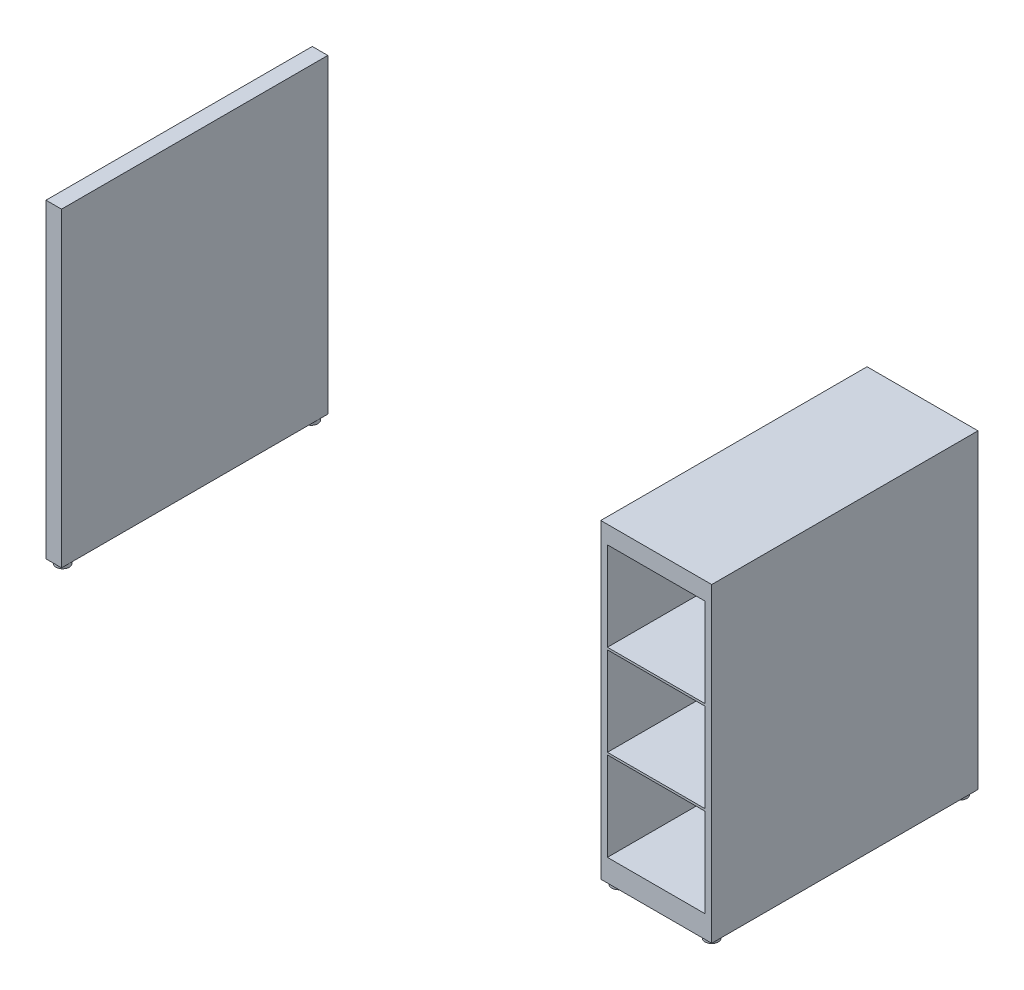
ISO-10303-21;
HEADER;
FILE_DESCRIPTION(('STEP AP214'),'2;1');
FILE_NAME('part.step','',(''),(''),'','','');
FILE_SCHEMA(('AUTOMOTIVE_DESIGN { 1 0 10303 214 1 1 1 1 }'));
ENDSEC;
DATA;
#1=APPLICATION_CONTEXT('core data for automotive mechanical design processes');
#2=APPLICATION_PROTOCOL_DEFINITION('international standard','automotive_design',2000,#1);
#3=PRODUCT_CONTEXT('',#1,'mechanical');
#4=PRODUCT('Part','Part','',(#3));
#5=PRODUCT_RELATED_PRODUCT_CATEGORY('part','',(#4));
#6=PRODUCT_DEFINITION_FORMATION('','',#4);
#7=PRODUCT_DEFINITION_CONTEXT('part definition',#1,'design');
#8=PRODUCT_DEFINITION('design','',#6,#7);
#9=PRODUCT_DEFINITION_SHAPE('','',#8);
#10=(LENGTH_UNIT() NAMED_UNIT(*) SI_UNIT(.MILLI.,.METRE.));
#11=(NAMED_UNIT(*) PLANE_ANGLE_UNIT() SI_UNIT($,.RADIAN.));
#12=(NAMED_UNIT(*) SI_UNIT($,.STERADIAN.) SOLID_ANGLE_UNIT());
#13=UNCERTAINTY_MEASURE_WITH_UNIT(LENGTH_MEASURE(1.E-05),#10,'distance_accuracy_value','');
#14=(GEOMETRIC_REPRESENTATION_CONTEXT(3) GLOBAL_UNCERTAINTY_ASSIGNED_CONTEXT((#13)) GLOBAL_UNIT_ASSIGNED_CONTEXT((#10,
#11,#12)) REPRESENTATION_CONTEXT('',''));
#15=CARTESIAN_POINT('',(0.,0.,0.));
#16=DIRECTION('',(0.,0.,1.));
#17=DIRECTION('',(1.,0.,0.));
#18=AXIS2_PLACEMENT_3D('',#15,#16,#17);
#19=CARTESIAN_POINT('',(-750.,700.,300.));
#20=DIRECTION('',(0.,0.,-1.));
#21=DIRECTION('',(-1.,0.,0.));
#22=AXIS2_PLACEMENT_3D('',#19,#20,#21);
#23=PLANE('',#22);
#24=DIRECTION('',(1.,0.,0.));
#25=VECTOR('',#24,1.);
#26=CARTESIAN_POINT('',(-750.,0.,300.));
#27=LINE('',#26,#25);
#28=CARTESIAN_POINT('',(-750.,0.,300.));
#29=VERTEX_POINT('',#28);
#30=CARTESIAN_POINT('',(-715.,0.,300.));
#31=VERTEX_POINT('',#30);
#32=EDGE_CURVE('E104',#29,#31,#27,.T.);
#33=ORIENTED_EDGE('',*,*,#32,.T.);
#34=DIRECTION('',(0.,-1.,0.));
#35=VECTOR('',#34,1.);
#36=CARTESIAN_POINT('',(-715.,0.,300.));
#37=LINE('',#36,#35);
#38=CARTESIAN_POINT('',(-715.,700.,300.));
#39=VERTEX_POINT('',#38);
#40=EDGE_CURVE('E89',#39,#31,#37,.T.);
#41=ORIENTED_EDGE('',*,*,#40,.F.);
#42=DIRECTION('',(1.,0.,0.));
#43=VECTOR('',#42,1.);
#44=CARTESIAN_POINT('',(-750.,700.,300.));
#45=LINE('',#44,#43);
#46=CARTESIAN_POINT('',(-750.,700.,300.));
#47=VERTEX_POINT('',#46);
#48=EDGE_CURVE('E102',#47,#39,#45,.T.);
#49=ORIENTED_EDGE('',*,*,#48,.F.);
#50=DIRECTION('',(0.,-1.,0.));
#51=VECTOR('',#50,1.);
#52=CARTESIAN_POINT('',(-750.,700.,300.));
#53=LINE('',#52,#51);
#54=EDGE_CURVE('E120',#47,#29,#53,.T.);
#55=ORIENTED_EDGE('',*,*,#54,.T.);
#56=EDGE_LOOP('',(#33,#41,#49,#55));
#57=FACE_BOUND('',#56,.T.);
#58=ADVANCED_FACE('F55',(#57),#23,.F.);
#59=CARTESIAN_POINT('',(-750.,700.,-300.));
#60=DIRECTION('',(0.,0.,1.));
#61=DIRECTION('',(1.,0.,0.));
#62=AXIS2_PLACEMENT_3D('',#59,#60,#61);
#63=PLANE('',#62);
#64=DIRECTION('',(-1.,0.,0.));
#65=VECTOR('',#64,1.);
#66=CARTESIAN_POINT('',(-750.,700.,-300.));
#67=LINE('',#66,#65);
#68=CARTESIAN_POINT('',(-715.,700.,-300.));
#69=VERTEX_POINT('',#68);
#70=CARTESIAN_POINT('',(-750.,700.,-300.));
#71=VERTEX_POINT('',#70);
#72=EDGE_CURVE('E114',#69,#71,#67,.T.);
#73=ORIENTED_EDGE('',*,*,#72,.F.);
#74=DIRECTION('',(0.,-1.,0.));
#75=VECTOR('',#74,1.);
#76=CARTESIAN_POINT('',(-715.,700.,-300.));
#77=LINE('',#76,#75);
#78=CARTESIAN_POINT('',(-715.,0.,-300.));
#79=VERTEX_POINT('',#78);
#80=EDGE_CURVE('E70',#69,#79,#77,.T.);
#81=ORIENTED_EDGE('',*,*,#80,.T.);
#82=DIRECTION('',(-1.,0.,0.));
#83=VECTOR('',#82,1.);
#84=CARTESIAN_POINT('',(-750.,0.,-300.));
#85=LINE('',#84,#83);
#86=CARTESIAN_POINT('',(-750.,0.,-300.));
#87=VERTEX_POINT('',#86);
#88=EDGE_CURVE('E118',#79,#87,#85,.T.);
#89=ORIENTED_EDGE('',*,*,#88,.T.);
#90=DIRECTION('',(0.,-1.,0.));
#91=VECTOR('',#90,1.);
#92=CARTESIAN_POINT('',(-750.,700.,-300.));
#93=LINE('',#92,#91);
#94=EDGE_CURVE('E96',#71,#87,#93,.T.);
#95=ORIENTED_EDGE('',*,*,#94,.F.);
#96=EDGE_LOOP('',(#73,#81,#89,#95));
#97=FACE_BOUND('',#96,.T.);
#98=ADVANCED_FACE('F138',(#97),#63,.F.);
#99=CARTESIAN_POINT('',(0.,700.,0.));
#100=DIRECTION('',(0.,1.,0.));
#101=DIRECTION('',(0.,0.,1.));
#102=AXIS2_PLACEMENT_3D('',#99,#100,#101);
#103=PLANE('',#102);
#104=DIRECTION('',(0.,0.,1.));
#105=VECTOR('',#104,1.);
#106=CARTESIAN_POINT('',(-715.,700.,-450.));
#107=LINE('',#106,#105);
#108=EDGE_CURVE('E91',#69,#39,#107,.T.);
#109=ORIENTED_EDGE('',*,*,#108,.F.);
#110=ORIENTED_EDGE('',*,*,#72,.T.);
#111=DIRECTION('',(0.,0.,1.));
#112=VECTOR('',#111,1.);
#113=CARTESIAN_POINT('',(-750.,700.,-300.));
#114=LINE('',#113,#112);
#115=EDGE_CURVE('E108',#71,#47,#114,.T.);
#116=ORIENTED_EDGE('',*,*,#115,.T.);
#117=ORIENTED_EDGE('',*,*,#48,.T.);
#118=EDGE_LOOP('',(#109,#110,#116,#117));
#119=FACE_BOUND('',#118,.T.);
#120=ADVANCED_FACE('F106',(#119),#103,.T.);
#121=CARTESIAN_POINT('',(0.,0.,0.));
#122=DIRECTION('',(0.,1.,0.));
#123=DIRECTION('',(0.,0.,1.));
#124=AXIS2_PLACEMENT_3D('',#121,#122,#123);
#125=PLANE('',#124);
#126=CARTESIAN_POINT('',(-732.5,0.,-280.));
#127=DIRECTION('',(0.,1.,0.));
#128=DIRECTION('',(0.,0.,1.));
#129=AXIS2_PLACEMENT_3D('',#126,#127,#128);
#130=CIRCLE('',#129,15.);
#131=CARTESIAN_POINT('',(-732.5,0.,-265.));
#132=VERTEX_POINT('',#131);
#133=EDGE_CURVE('E12',#132,#132,#130,.F.);
#134=ORIENTED_EDGE('',*,*,#133,.F.);
#135=EDGE_LOOP('',(#134));
#136=FACE_BOUND('',#135,.T.);
#137=CARTESIAN_POINT('',(-732.5,0.,280.));
#138=DIRECTION('',(0.,1.,0.));
#139=DIRECTION('',(0.,0.,1.));
#140=AXIS2_PLACEMENT_3D('',#137,#138,#139);
#141=CIRCLE('',#140,15.);
#142=CARTESIAN_POINT('',(-732.5,0.,295.));
#143=VERTEX_POINT('',#142);
#144=EDGE_CURVE('E63',#143,#143,#141,.F.);
#145=ORIENTED_EDGE('',*,*,#144,.F.);
#146=EDGE_LOOP('',(#145));
#147=FACE_BOUND('',#146,.T.);
#148=ORIENTED_EDGE('',*,*,#88,.F.);
#149=DIRECTION('',(0.,0.,1.));
#150=VECTOR('',#149,1.);
#151=CARTESIAN_POINT('',(-715.,0.,0.));
#152=LINE('',#151,#150);
#153=EDGE_CURVE('E110',#79,#31,#152,.T.);
#154=ORIENTED_EDGE('',*,*,#153,.T.);
#155=ORIENTED_EDGE('',*,*,#32,.F.);
#156=DIRECTION('',(0.,0.,1.));
#157=VECTOR('',#156,1.);
#158=CARTESIAN_POINT('',(-750.,0.,-300.));
#159=LINE('',#158,#157);
#160=EDGE_CURVE('E112',#87,#29,#159,.T.);
#161=ORIENTED_EDGE('',*,*,#160,.F.);
#162=EDGE_LOOP('',(#148,#154,#155,#161));
#163=FACE_BOUND('',#162,.T.);
#164=ADVANCED_FACE('F127',(#136,#147,#163),#125,.F.);
#165=CARTESIAN_POINT('',(-750.,700.,-300.));
#166=DIRECTION('',(1.,0.,0.));
#167=DIRECTION('',(0.,0.,-1.));
#168=AXIS2_PLACEMENT_3D('',#165,#166,#167);
#169=PLANE('',#168);
#170=ORIENTED_EDGE('',*,*,#160,.T.);
#171=ORIENTED_EDGE('',*,*,#54,.F.);
#172=ORIENTED_EDGE('',*,*,#115,.F.);
#173=ORIENTED_EDGE('',*,*,#94,.T.);
#174=EDGE_LOOP('',(#170,#171,#172,#173));
#175=FACE_BOUND('',#174,.T.);
#176=ADVANCED_FACE('F130',(#175),#169,.F.);
#177=CARTESIAN_POINT('',(-715.,0.,-450.));
#178=DIRECTION('',(-1.,0.,0.));
#179=DIRECTION('',(0.,0.,1.));
#180=AXIS2_PLACEMENT_3D('',#177,#178,#179);
#181=PLANE('',#180);
#182=ORIENTED_EDGE('',*,*,#108,.T.);
#183=ORIENTED_EDGE('',*,*,#40,.T.);
#184=ORIENTED_EDGE('',*,*,#153,.F.);
#185=ORIENTED_EDGE('',*,*,#80,.F.);
#186=EDGE_LOOP('',(#182,#183,#184,#185));
#187=FACE_BOUND('',#186,.T.);
#188=ADVANCED_FACE('F92',(#187),#181,.F.);
#189=CARTESIAN_POINT('',(-732.5,-10.,280.));
#190=DIRECTION('',(0.,1.,0.));
#191=DIRECTION('',(0.,0.,1.));
#192=AXIS2_PLACEMENT_3D('',#189,#190,#191);
#193=CYLINDRICAL_SURFACE('',#192,15.);
#194=CARTESIAN_POINT('',(-732.5,-10.,280.));
#195=DIRECTION('',(0.,-1.,0.));
#196=DIRECTION('',(0.,0.,-1.));
#197=AXIS2_PLACEMENT_3D('',#194,#195,#196);
#198=CIRCLE('',#197,15.);
#199=CARTESIAN_POINT('',(-732.5,-10.,265.));
#200=VERTEX_POINT('',#199);
#201=EDGE_CURVE('E121',#200,#200,#198,.T.);
#202=ORIENTED_EDGE('',*,*,#201,.F.);
#203=EDGE_LOOP('',(#202));
#204=FACE_BOUND('',#203,.T.);
#205=ORIENTED_EDGE('',*,*,#144,.T.);
#206=EDGE_LOOP('',(#205));
#207=FACE_BOUND('',#206,.T.);
#208=ADVANCED_FACE('F125',(#204,#207),#193,.T.);
#209=CARTESIAN_POINT('',(-732.5,-10.,280.));
#210=DIRECTION('',(0.,-1.,0.));
#211=DIRECTION('',(0.,0.,-1.));
#212=AXIS2_PLACEMENT_3D('',#209,#210,#211);
#213=PLANE('',#212);
#214=ORIENTED_EDGE('',*,*,#201,.T.);
#215=EDGE_LOOP('',(#214));
#216=FACE_BOUND('',#215,.T.);
#217=ADVANCED_FACE('F156',(#216),#213,.T.);
#218=CARTESIAN_POINT('',(-732.5,-10.,-280.));
#219=DIRECTION('',(0.,1.,0.));
#220=DIRECTION('',(0.,0.,1.));
#221=AXIS2_PLACEMENT_3D('',#218,#219,#220);
#222=CYLINDRICAL_SURFACE('',#221,15.);
#223=CARTESIAN_POINT('',(-732.5,-10.,-280.));
#224=DIRECTION('',(0.,-1.,0.));
#225=DIRECTION('',(0.,0.,-1.));
#226=AXIS2_PLACEMENT_3D('',#223,#224,#225);
#227=CIRCLE('',#226,15.);
#228=CARTESIAN_POINT('',(-732.5,-10.,-295.));
#229=VERTEX_POINT('',#228);
#230=EDGE_CURVE('E147',#229,#229,#227,.T.);
#231=ORIENTED_EDGE('',*,*,#230,.F.);
#232=EDGE_LOOP('',(#231));
#233=FACE_BOUND('',#232,.T.);
#234=ORIENTED_EDGE('',*,*,#133,.T.);
#235=EDGE_LOOP('',(#234));
#236=FACE_BOUND('',#235,.T.);
#237=ADVANCED_FACE('F153',(#233,#236),#222,.T.);
#238=CARTESIAN_POINT('',(-732.5,-10.,-280.));
#239=DIRECTION('',(0.,-1.,0.));
#240=DIRECTION('',(0.,0.,-1.));
#241=AXIS2_PLACEMENT_3D('',#238,#239,#240);
#242=PLANE('',#241);
#243=ORIENTED_EDGE('',*,*,#230,.T.);
#244=EDGE_LOOP('',(#243));
#245=FACE_BOUND('',#244,.T.);
#246=ADVANCED_FACE('F151',(#245),#242,.T.);
#247=CLOSED_SHELL('',(#58,#98,#120,#164,#176,#188,#208,#217,#237,#246));
#248=MANIFOLD_SOLID_BREP('B2',#247);
#249=CARTESIAN_POINT('',(750.,700.,300.));
#250=DIRECTION('',(-1.,0.,0.));
#251=DIRECTION('',(0.,0.,1.));
#252=AXIS2_PLACEMENT_3D('',#249,#250,#251);
#253=PLANE('',#252);
#254=DIRECTION('',(0.,0.,-1.));
#255=VECTOR('',#254,1.);
#256=CARTESIAN_POINT('',(750.,0.,300.));
#257=LINE('',#256,#255);
#258=CARTESIAN_POINT('',(750.,0.,300.));
#259=VERTEX_POINT('',#258);
#260=CARTESIAN_POINT('',(750.,0.,-300.));
#261=VERTEX_POINT('',#260);
#262=EDGE_CURVE('E538',#259,#261,#257,.T.);
#263=ORIENTED_EDGE('',*,*,#262,.T.);
#264=DIRECTION('',(0.,-1.,0.));
#265=VECTOR('',#264,1.);
#266=CARTESIAN_POINT('',(750.,700.,-300.));
#267=LINE('',#266,#265);
#268=CARTESIAN_POINT('',(750.,700.,-300.));
#269=VERTEX_POINT('',#268);
#270=EDGE_CURVE('E535',#269,#261,#267,.T.);
#271=ORIENTED_EDGE('',*,*,#270,.F.);
#272=DIRECTION('',(0.,0.,-1.));
#273=VECTOR('',#272,1.);
#274=CARTESIAN_POINT('',(750.,700.,300.));
#275=LINE('',#274,#273);
#276=CARTESIAN_POINT('',(750.,700.,300.));
#277=VERTEX_POINT('',#276);
#278=EDGE_CURVE('E527',#277,#269,#275,.T.);
#279=ORIENTED_EDGE('',*,*,#278,.F.);
#280=DIRECTION('',(0.,-1.,0.));
#281=VECTOR('',#280,1.);
#282=CARTESIAN_POINT('',(750.,700.,300.));
#283=LINE('',#282,#281);
#284=EDGE_CURVE('E547',#277,#259,#283,.T.);
#285=ORIENTED_EDGE('',*,*,#284,.T.);
#286=EDGE_LOOP('',(#263,#271,#279,#285));
#287=FACE_BOUND('',#286,.T.);
#288=ADVANCED_FACE('F259',(#287),#253,.F.);
#289=CARTESIAN_POINT('',(0.,700.,0.));
#290=DIRECTION('',(0.,1.,0.));
#291=DIRECTION('',(0.,0.,1.));
#292=AXIS2_PLACEMENT_3D('',#289,#290,#291);
#293=PLANE('',#292);
#294=DIRECTION('',(0.,0.,1.));
#295=VECTOR('',#294,1.);
#296=CARTESIAN_POINT('',(500.,700.,-450.));
#297=LINE('',#296,#295);
#298=CARTESIAN_POINT('',(500.,700.,-300.));
#299=VERTEX_POINT('',#298);
#300=CARTESIAN_POINT('',(500.,700.,300.));
#301=VERTEX_POINT('',#300);
#302=EDGE_CURVE('E515',#299,#301,#297,.T.);
#303=ORIENTED_EDGE('',*,*,#302,.T.);
#304=DIRECTION('',(1.,0.,0.));
#305=VECTOR('',#304,1.);
#306=CARTESIAN_POINT('',(-750.,700.,300.));
#307=LINE('',#306,#305);
#308=EDGE_CURVE('E524',#301,#277,#307,.T.);
#309=ORIENTED_EDGE('',*,*,#308,.T.);
#310=ORIENTED_EDGE('',*,*,#278,.T.);
#311=DIRECTION('',(-1.,0.,0.));
#312=VECTOR('',#311,1.);
#313=CARTESIAN_POINT('',(-750.,700.,-300.));
#314=LINE('',#313,#312);
#315=EDGE_CURVE('E531',#269,#299,#314,.T.);
#316=ORIENTED_EDGE('',*,*,#315,.T.);
#317=EDGE_LOOP('',(#303,#309,#310,#316));
#318=FACE_BOUND('',#317,.T.);
#319=ADVANCED_FACE('F572',(#318),#293,.T.);
#320=CARTESIAN_POINT('',(0.,0.,0.));
#321=DIRECTION('',(0.,1.,0.));
#322=DIRECTION('',(0.,0.,1.));
#323=AXIS2_PLACEMENT_3D('',#320,#321,#322);
#324=PLANE('',#323);
#325=CARTESIAN_POINT('',(730.,0.,280.));
#326=DIRECTION('',(0.,1.,0.));
#327=DIRECTION('',(0.,0.,1.));
#328=AXIS2_PLACEMENT_3D('',#325,#326,#327);
#329=CIRCLE('',#328,15.);
#330=CARTESIAN_POINT('',(730.,0.,295.));
#331=VERTEX_POINT('',#330);
#332=EDGE_CURVE('E53',#331,#331,#329,.F.);
#333=ORIENTED_EDGE('',*,*,#332,.F.);
#334=EDGE_LOOP('',(#333));
#335=FACE_BOUND('',#334,.T.);
#336=CARTESIAN_POINT('',(730.,0.,-280.));
#337=DIRECTION('',(0.,1.,0.));
#338=DIRECTION('',(0.,0.,1.));
#339=AXIS2_PLACEMENT_3D('',#336,#337,#338);
#340=CIRCLE('',#339,15.);
#341=CARTESIAN_POINT('',(730.,0.,-265.));
#342=VERTEX_POINT('',#341);
#343=EDGE_CURVE('E268',#342,#342,#340,.F.);
#344=ORIENTED_EDGE('',*,*,#343,.F.);
#345=EDGE_LOOP('',(#344));
#346=FACE_BOUND('',#345,.T.);
#347=CARTESIAN_POINT('',(520.,0.,-280.));
#348=DIRECTION('',(0.,1.,0.));
#349=DIRECTION('',(0.,0.,1.));
#350=AXIS2_PLACEMENT_3D('',#347,#348,#349);
#351=CIRCLE('',#350,15.);
#352=CARTESIAN_POINT('',(520.,0.,-265.));
#353=VERTEX_POINT('',#352);
#354=EDGE_CURVE('E559',#353,#353,#351,.F.);
#355=ORIENTED_EDGE('',*,*,#354,.F.);
#356=EDGE_LOOP('',(#355));
#357=FACE_BOUND('',#356,.T.);
#358=CARTESIAN_POINT('',(520.,0.,280.));
#359=DIRECTION('',(0.,1.,0.));
#360=DIRECTION('',(0.,0.,1.));
#361=AXIS2_PLACEMENT_3D('',#358,#359,#360);
#362=CIRCLE('',#361,15.);
#363=CARTESIAN_POINT('',(520.,0.,295.));
#364=VERTEX_POINT('',#363);
#365=EDGE_CURVE('E555',#364,#364,#362,.F.);
#366=ORIENTED_EDGE('',*,*,#365,.F.);
#367=EDGE_LOOP('',(#366));
#368=FACE_BOUND('',#367,.T.);
#369=DIRECTION('',(1.,0.,0.));
#370=VECTOR('',#369,1.);
#371=CARTESIAN_POINT('',(-750.,0.,300.));
#372=LINE('',#371,#370);
#373=CARTESIAN_POINT('',(500.,0.,300.));
#374=VERTEX_POINT('',#373);
#375=EDGE_CURVE('E523',#374,#259,#372,.T.);
#376=ORIENTED_EDGE('',*,*,#375,.F.);
#377=DIRECTION('',(0.,0.,-1.));
#378=VECTOR('',#377,1.);
#379=CARTESIAN_POINT('',(500.,0.,0.));
#380=LINE('',#379,#378);
#381=CARTESIAN_POINT('',(500.,0.,-300.));
#382=VERTEX_POINT('',#381);
#383=EDGE_CURVE('E551',#374,#382,#380,.T.);
#384=ORIENTED_EDGE('',*,*,#383,.T.);
#385=DIRECTION('',(-1.,0.,0.));
#386=VECTOR('',#385,1.);
#387=CARTESIAN_POINT('',(-750.,0.,-300.));
#388=LINE('',#387,#386);
#389=EDGE_CURVE('E528',#261,#382,#388,.T.);
#390=ORIENTED_EDGE('',*,*,#389,.F.);
#391=ORIENTED_EDGE('',*,*,#262,.F.);
#392=EDGE_LOOP('',(#376,#384,#390,#391));
#393=FACE_BOUND('',#392,.T.);
#394=ADVANCED_FACE('F568',(#335,#346,#357,#368,#393),#324,.F.);
#395=CARTESIAN_POINT('',(-750.,700.,-300.));
#396=DIRECTION('',(0.,0.,1.));
#397=DIRECTION('',(1.,0.,0.));
#398=AXIS2_PLACEMENT_3D('',#395,#396,#397);
#399=PLANE('',#398);
#400=ORIENTED_EDGE('',*,*,#389,.T.);
#401=DIRECTION('',(0.,1.,0.));
#402=VECTOR('',#401,1.);
#403=CARTESIAN_POINT('',(500.,700.,-300.));
#404=LINE('',#403,#402);
#405=EDGE_CURVE('E519',#382,#299,#404,.T.);
#406=ORIENTED_EDGE('',*,*,#405,.T.);
#407=ORIENTED_EDGE('',*,*,#315,.F.);
#408=ORIENTED_EDGE('',*,*,#270,.T.);
#409=EDGE_LOOP('',(#400,#406,#407,#408));
#410=FACE_BOUND('',#409,.T.);
#411=ADVANCED_FACE('F571',(#410),#399,.F.);
#412=CARTESIAN_POINT('',(-750.,700.,300.));
#413=DIRECTION('',(0.,0.,-1.));
#414=DIRECTION('',(-1.,0.,0.));
#415=AXIS2_PLACEMENT_3D('',#412,#413,#414);
#416=PLANE('',#415);
#417=DIRECTION('',(0.,-1.,0.));
#418=VECTOR('',#417,1.);
#419=CARTESIAN_POINT('',(515.,660.,300.));
#420=LINE('',#419,#418);
#421=CARTESIAN_POINT('',(515.,660.,300.));
#422=VERTEX_POINT('',#421);
#423=CARTESIAN_POINT('',(515.,460.099912453158,300.));
#424=VERTEX_POINT('',#423);
#425=EDGE_CURVE('E412',#422,#424,#420,.T.);
#426=ORIENTED_EDGE('',*,*,#425,.F.);
#427=DIRECTION('',(-0.999999896875566,-0.000454146295559758,0.));
#428=VECTOR('',#427,1.);
#429=CARTESIAN_POINT('',(515.,660.,300.));
#430=LINE('',#429,#428);
#431=CARTESIAN_POINT('',(735.000567728672,660.099912453158,300.));
#432=VERTEX_POINT('',#431);
#433=EDGE_CURVE('E275',#432,#422,#430,.T.);
#434=ORIENTED_EDGE('',*,*,#433,.F.);
#435=DIRECTION('',(0.,1.,0.));
#436=VECTOR('',#435,1.);
#437=CARTESIAN_POINT('',(735.000567728672,660.099912453158,300.));
#438=LINE('',#437,#436);
#439=CARTESIAN_POINT('',(735.000567728672,460.099912453158,300.));
#440=VERTEX_POINT('',#439);
#441=EDGE_CURVE('E396',#440,#432,#438,.T.);
#442=ORIENTED_EDGE('',*,*,#441,.F.);
#443=DIRECTION('',(1.,0.,0.));
#444=VECTOR('',#443,1.);
#445=CARTESIAN_POINT('',(735.000567728672,460.099912453158,300.));
#446=LINE('',#445,#444);
#447=EDGE_CURVE('E400',#424,#440,#446,.T.);
#448=ORIENTED_EDGE('',*,*,#447,.F.);
#449=EDGE_LOOP('',(#426,#434,#442,#448));
#450=FACE_BOUND('',#449,.T.);
#451=DIRECTION('',(0.,1.,0.));
#452=VECTOR('',#451,1.);
#453=CARTESIAN_POINT('',(735.000567728672,455.099912453158,300.));
#454=LINE('',#453,#452);
#455=CARTESIAN_POINT('',(735.000567728672,255.099912453158,300.));
#456=VERTEX_POINT('',#455);
#457=CARTESIAN_POINT('',(735.000567728672,455.099912453158,300.));
#458=VERTEX_POINT('',#457);
#459=EDGE_CURVE('E450',#456,#458,#454,.T.);
#460=ORIENTED_EDGE('',*,*,#459,.F.);
#461=DIRECTION('',(1.,0.,0.));
#462=VECTOR('',#461,1.);
#463=CARTESIAN_POINT('',(735.000567728672,255.099912453158,300.));
#464=LINE('',#463,#462);
#465=CARTESIAN_POINT('',(515.,255.099912453158,300.));
#466=VERTEX_POINT('',#465);
#467=EDGE_CURVE('E283',#466,#456,#464,.T.);
#468=ORIENTED_EDGE('',*,*,#467,.F.);
#469=DIRECTION('',(0.,-1.,0.));
#470=VECTOR('',#469,1.);
#471=CARTESIAN_POINT('',(515.,455.099912453158,300.));
#472=LINE('',#471,#470);
#473=CARTESIAN_POINT('',(515.,455.099912453158,300.));
#474=VERTEX_POINT('',#473);
#475=EDGE_CURVE('E441',#474,#466,#472,.T.);
#476=ORIENTED_EDGE('',*,*,#475,.F.);
#477=DIRECTION('',(-1.,0.,0.));
#478=VECTOR('',#477,1.);
#479=CARTESIAN_POINT('',(735.000567728672,455.099912453158,300.));
#480=LINE('',#479,#478);
#481=EDGE_CURVE('E445',#458,#474,#480,.T.);
#482=ORIENTED_EDGE('',*,*,#481,.F.);
#483=EDGE_LOOP('',(#460,#468,#476,#482));
#484=FACE_BOUND('',#483,.T.);
#485=DIRECTION('',(0.,-1.,0.));
#486=VECTOR('',#485,1.);
#487=CARTESIAN_POINT('',(515.,250.099912453158,300.));
#488=LINE('',#487,#486);
#489=CARTESIAN_POINT('',(515.,250.099912453158,300.));
#490=VERTEX_POINT('',#489);
#491=CARTESIAN_POINT('',(515.,50.0999124531583,300.));
#492=VERTEX_POINT('',#491);
#493=EDGE_CURVE('E493',#490,#492,#488,.T.);
#494=ORIENTED_EDGE('',*,*,#493,.F.);
#495=DIRECTION('',(-1.,0.,0.));
#496=VECTOR('',#495,1.);
#497=CARTESIAN_POINT('',(735.000567728672,250.099912453158,300.));
#498=LINE('',#497,#496);
#499=CARTESIAN_POINT('',(735.000567728672,250.099912453158,300.));
#500=VERTEX_POINT('',#499);
#501=EDGE_CURVE('E440',#500,#490,#498,.T.);
#502=ORIENTED_EDGE('',*,*,#501,.F.);
#503=DIRECTION('',(0.,1.,0.));
#504=VECTOR('',#503,1.);
#505=CARTESIAN_POINT('',(735.000567728672,250.099912453158,300.));
#506=LINE('',#505,#504);
#507=CARTESIAN_POINT('',(735.000567728672,50.0999124531583,300.));
#508=VERTEX_POINT('',#507);
#509=EDGE_CURVE('E484',#508,#500,#506,.T.);
#510=ORIENTED_EDGE('',*,*,#509,.F.);
#511=DIRECTION('',(1.,0.,0.));
#512=VECTOR('',#511,1.);
#513=CARTESIAN_POINT('',(735.000567728672,50.0999124531583,300.));
#514=LINE('',#513,#512);
#515=EDGE_CURVE('E488',#492,#508,#514,.T.);
#516=ORIENTED_EDGE('',*,*,#515,.F.);
#517=EDGE_LOOP('',(#494,#502,#510,#516));
#518=FACE_BOUND('',#517,.T.);
#519=ORIENTED_EDGE('',*,*,#308,.F.);
#520=DIRECTION('',(0.,1.,0.));
#521=VECTOR('',#520,1.);
#522=CARTESIAN_POINT('',(500.,700.,300.));
#523=LINE('',#522,#521);
#524=EDGE_CURVE('E421',#374,#301,#523,.T.);
#525=ORIENTED_EDGE('',*,*,#524,.F.);
#526=ORIENTED_EDGE('',*,*,#375,.T.);
#527=ORIENTED_EDGE('',*,*,#284,.F.);
#528=EDGE_LOOP('',(#519,#525,#526,#527));
#529=FACE_BOUND('',#528,.T.);
#530=ADVANCED_FACE('F261',(#450,#484,#518,#529),#416,.F.);
#531=CARTESIAN_POINT('',(500.,700.,-450.));
#532=DIRECTION('',(1.,0.,0.));
#533=DIRECTION('',(0.,0.,-1.));
#534=AXIS2_PLACEMENT_3D('',#531,#532,#533);
#535=PLANE('',#534);
#536=ORIENTED_EDGE('',*,*,#383,.F.);
#537=ORIENTED_EDGE('',*,*,#524,.T.);
#538=ORIENTED_EDGE('',*,*,#302,.F.);
#539=ORIENTED_EDGE('',*,*,#405,.F.);
#540=EDGE_LOOP('',(#536,#537,#538,#539));
#541=FACE_BOUND('',#540,.T.);
#542=ADVANCED_FACE('F587',(#541),#535,.F.);
#543=CARTESIAN_POINT('',(735.000567728672,250.099912453158,-280.));
#544=DIRECTION('',(0.,1.,0.));
#545=DIRECTION('',(0.,0.,1.));
#546=AXIS2_PLACEMENT_3D('',#543,#544,#545);
#547=PLANE('',#546);
#548=ORIENTED_EDGE('',*,*,#501,.T.);
#549=DIRECTION('',(0.,0.,1.));
#550=VECTOR('',#549,1.);
#551=CARTESIAN_POINT('',(515.,250.099912453158,-280.));
#552=LINE('',#551,#550);
#553=CARTESIAN_POINT('',(515.,250.099912453158,-280.));
#554=VERTEX_POINT('',#553);
#555=EDGE_CURVE('E470',#554,#490,#552,.T.);
#556=ORIENTED_EDGE('',*,*,#555,.F.);
#557=DIRECTION('',(-1.,0.,0.));
#558=VECTOR('',#557,1.);
#559=CARTESIAN_POINT('',(735.000567728672,250.099912453158,-280.));
#560=LINE('',#559,#558);
#561=CARTESIAN_POINT('',(735.000567728672,250.099912453158,-280.));
#562=VERTEX_POINT('',#561);
#563=EDGE_CURVE('E489',#562,#554,#560,.T.);
#564=ORIENTED_EDGE('',*,*,#563,.F.);
#565=DIRECTION('',(0.,0.,1.));
#566=VECTOR('',#565,1.);
#567=CARTESIAN_POINT('',(735.000567728672,250.099912453158,-280.));
#568=LINE('',#567,#566);
#569=EDGE_CURVE('E481',#562,#500,#568,.T.);
#570=ORIENTED_EDGE('',*,*,#569,.T.);
#571=EDGE_LOOP('',(#548,#556,#564,#570));
#572=FACE_BOUND('',#571,.T.);
#573=ADVANCED_FACE('F604',(#572),#547,.F.);
#574=CARTESIAN_POINT('',(735.000567728672,250.099912453158,-280.));
#575=DIRECTION('',(1.,0.,0.));
#576=DIRECTION('',(0.,0.,-1.));
#577=AXIS2_PLACEMENT_3D('',#574,#575,#576);
#578=PLANE('',#577);
#579=ORIENTED_EDGE('',*,*,#509,.T.);
#580=ORIENTED_EDGE('',*,*,#569,.F.);
#581=DIRECTION('',(0.,1.,0.));
#582=VECTOR('',#581,1.);
#583=CARTESIAN_POINT('',(735.000567728672,250.099912453158,-280.));
#584=LINE('',#583,#582);
#585=CARTESIAN_POINT('',(735.000567728672,50.0999124531583,-280.));
#586=VERTEX_POINT('',#585);
#587=EDGE_CURVE('E474',#586,#562,#584,.T.);
#588=ORIENTED_EDGE('',*,*,#587,.F.);
#589=DIRECTION('',(0.,0.,1.));
#590=VECTOR('',#589,1.);
#591=CARTESIAN_POINT('',(735.000567728672,50.0999124531583,-280.));
#592=LINE('',#591,#590);
#593=EDGE_CURVE('E478',#586,#508,#592,.T.);
#594=ORIENTED_EDGE('',*,*,#593,.T.);
#595=EDGE_LOOP('',(#579,#580,#588,#594));
#596=FACE_BOUND('',#595,.T.);
#597=ADVANCED_FACE('F611',(#596),#578,.F.);
#598=CARTESIAN_POINT('',(735.000567728672,50.0999124531583,-280.));
#599=DIRECTION('',(0.,-1.,0.));
#600=DIRECTION('',(0.,0.,-1.));
#601=AXIS2_PLACEMENT_3D('',#598,#599,#600);
#602=PLANE('',#601);
#603=ORIENTED_EDGE('',*,*,#515,.T.);
#604=ORIENTED_EDGE('',*,*,#593,.F.);
#605=DIRECTION('',(1.,0.,0.));
#606=VECTOR('',#605,1.);
#607=CARTESIAN_POINT('',(735.000567728672,50.0999124531583,-280.));
#608=LINE('',#607,#606);
#609=CARTESIAN_POINT('',(515.,50.0999124531583,-280.));
#610=VERTEX_POINT('',#609);
#611=EDGE_CURVE('E502',#610,#586,#608,.T.);
#612=ORIENTED_EDGE('',*,*,#611,.F.);
#613=DIRECTION('',(0.,0.,1.));
#614=VECTOR('',#613,1.);
#615=CARTESIAN_POINT('',(515.,50.0999124531583,-280.));
#616=LINE('',#615,#614);
#617=EDGE_CURVE('E475',#610,#492,#616,.T.);
#618=ORIENTED_EDGE('',*,*,#617,.T.);
#619=EDGE_LOOP('',(#603,#604,#612,#618));
#620=FACE_BOUND('',#619,.T.);
#621=ADVANCED_FACE('F614',(#620),#602,.F.);
#622=CARTESIAN_POINT('',(515.,250.099912453158,-280.));
#623=DIRECTION('',(-1.,0.,0.));
#624=DIRECTION('',(0.,0.,1.));
#625=AXIS2_PLACEMENT_3D('',#622,#623,#624);
#626=PLANE('',#625);
#627=ORIENTED_EDGE('',*,*,#493,.T.);
#628=ORIENTED_EDGE('',*,*,#617,.F.);
#629=DIRECTION('',(0.,-1.,0.));
#630=VECTOR('',#629,1.);
#631=CARTESIAN_POINT('',(515.,250.099912453158,-280.));
#632=LINE('',#631,#630);
#633=EDGE_CURVE('E506',#554,#610,#632,.T.);
#634=ORIENTED_EDGE('',*,*,#633,.F.);
#635=ORIENTED_EDGE('',*,*,#555,.T.);
#636=EDGE_LOOP('',(#627,#628,#634,#635));
#637=FACE_BOUND('',#636,.T.);
#638=ADVANCED_FACE('F609',(#637),#626,.F.);
#639=CARTESIAN_POINT('',(0.,0.,-280.));
#640=DIRECTION('',(0.,0.,1.));
#641=DIRECTION('',(1.,0.,0.));
#642=AXIS2_PLACEMENT_3D('',#639,#640,#641);
#643=PLANE('',#642);
#644=ORIENTED_EDGE('',*,*,#563,.T.);
#645=ORIENTED_EDGE('',*,*,#633,.T.);
#646=ORIENTED_EDGE('',*,*,#611,.T.);
#647=ORIENTED_EDGE('',*,*,#587,.T.);
#648=EDGE_LOOP('',(#644,#645,#646,#647));
#649=FACE_BOUND('',#648,.T.);
#650=ADVANCED_FACE('F605',(#649),#643,.T.);
#651=CARTESIAN_POINT('',(735.000567728672,255.099912453158,-280.));
#652=DIRECTION('',(0.,-1.,0.));
#653=DIRECTION('',(0.,0.,-1.));
#654=AXIS2_PLACEMENT_3D('',#651,#652,#653);
#655=PLANE('',#654);
#656=ORIENTED_EDGE('',*,*,#467,.T.);
#657=DIRECTION('',(0.,0.,1.));
#658=VECTOR('',#657,1.);
#659=CARTESIAN_POINT('',(735.000567728672,255.099912453158,-280.));
#660=LINE('',#659,#658);
#661=CARTESIAN_POINT('',(735.000567728672,255.099912453158,-280.));
#662=VERTEX_POINT('',#661);
#663=EDGE_CURVE('E427',#662,#456,#660,.T.);
#664=ORIENTED_EDGE('',*,*,#663,.F.);
#665=DIRECTION('',(1.,0.,0.));
#666=VECTOR('',#665,1.);
#667=CARTESIAN_POINT('',(735.000567728672,255.099912453158,-280.));
#668=LINE('',#667,#666);
#669=CARTESIAN_POINT('',(515.,255.099912453158,-280.));
#670=VERTEX_POINT('',#669);
#671=EDGE_CURVE('E446',#670,#662,#668,.T.);
#672=ORIENTED_EDGE('',*,*,#671,.F.);
#673=DIRECTION('',(0.,0.,1.));
#674=VECTOR('',#673,1.);
#675=CARTESIAN_POINT('',(515.,255.099912453158,-280.));
#676=LINE('',#675,#674);
#677=EDGE_CURVE('E437',#670,#466,#676,.T.);
#678=ORIENTED_EDGE('',*,*,#677,.T.);
#679=EDGE_LOOP('',(#656,#664,#672,#678));
#680=FACE_BOUND('',#679,.T.);
#681=ADVANCED_FACE('F608',(#680),#655,.F.);
#682=CARTESIAN_POINT('',(515.,455.099912453158,-280.));
#683=DIRECTION('',(-1.,0.,0.));
#684=DIRECTION('',(0.,0.,1.));
#685=AXIS2_PLACEMENT_3D('',#682,#683,#684);
#686=PLANE('',#685);
#687=ORIENTED_EDGE('',*,*,#475,.T.);
#688=ORIENTED_EDGE('',*,*,#677,.F.);
#689=DIRECTION('',(0.,-1.,0.));
#690=VECTOR('',#689,1.);
#691=CARTESIAN_POINT('',(515.,455.099912453158,-280.));
#692=LINE('',#691,#690);
#693=CARTESIAN_POINT('',(515.,455.099912453158,-280.));
#694=VERTEX_POINT('',#693);
#695=EDGE_CURVE('E430',#694,#670,#692,.T.);
#696=ORIENTED_EDGE('',*,*,#695,.F.);
#697=DIRECTION('',(0.,0.,1.));
#698=VECTOR('',#697,1.);
#699=CARTESIAN_POINT('',(515.,455.099912453158,-280.));
#700=LINE('',#699,#698);
#701=EDGE_CURVE('E434',#694,#474,#700,.T.);
#702=ORIENTED_EDGE('',*,*,#701,.T.);
#703=EDGE_LOOP('',(#687,#688,#696,#702));
#704=FACE_BOUND('',#703,.T.);
#705=ADVANCED_FACE('F630',(#704),#686,.F.);
#706=CARTESIAN_POINT('',(735.000567728672,455.099912453158,-280.));
#707=DIRECTION('',(0.,1.,0.));
#708=DIRECTION('',(0.,0.,1.));
#709=AXIS2_PLACEMENT_3D('',#706,#707,#708);
#710=PLANE('',#709);
#711=ORIENTED_EDGE('',*,*,#481,.T.);
#712=ORIENTED_EDGE('',*,*,#701,.F.);
#713=DIRECTION('',(-1.,0.,0.));
#714=VECTOR('',#713,1.);
#715=CARTESIAN_POINT('',(735.000567728672,455.099912453158,-280.));
#716=LINE('',#715,#714);
#717=CARTESIAN_POINT('',(735.000567728672,455.099912453158,-280.));
#718=VERTEX_POINT('',#717);
#719=EDGE_CURVE('E459',#718,#694,#716,.T.);
#720=ORIENTED_EDGE('',*,*,#719,.F.);
#721=DIRECTION('',(0.,0.,1.));
#722=VECTOR('',#721,1.);
#723=CARTESIAN_POINT('',(735.000567728672,455.099912453158,-280.));
#724=LINE('',#723,#722);
#725=EDGE_CURVE('E431',#718,#458,#724,.T.);
#726=ORIENTED_EDGE('',*,*,#725,.T.);
#727=EDGE_LOOP('',(#711,#712,#720,#726));
#728=FACE_BOUND('',#727,.T.);
#729=ADVANCED_FACE('F633',(#728),#710,.F.);
#730=CARTESIAN_POINT('',(735.000567728672,455.099912453158,-280.));
#731=DIRECTION('',(1.,0.,0.));
#732=DIRECTION('',(0.,0.,-1.));
#733=AXIS2_PLACEMENT_3D('',#730,#731,#732);
#734=PLANE('',#733);
#735=ORIENTED_EDGE('',*,*,#459,.T.);
#736=ORIENTED_EDGE('',*,*,#725,.F.);
#737=DIRECTION('',(0.,1.,0.));
#738=VECTOR('',#737,1.);
#739=CARTESIAN_POINT('',(735.000567728672,455.099912453158,-280.));
#740=LINE('',#739,#738);
#741=EDGE_CURVE('E463',#662,#718,#740,.T.);
#742=ORIENTED_EDGE('',*,*,#741,.F.);
#743=ORIENTED_EDGE('',*,*,#663,.T.);
#744=EDGE_LOOP('',(#735,#736,#742,#743));
#745=FACE_BOUND('',#744,.T.);
#746=ADVANCED_FACE('F628',(#745),#734,.F.);
#747=CARTESIAN_POINT('',(0.,0.,-280.));
#748=DIRECTION('',(0.,0.,1.));
#749=DIRECTION('',(1.,0.,0.));
#750=AXIS2_PLACEMENT_3D('',#747,#748,#749);
#751=PLANE('',#750);
#752=ORIENTED_EDGE('',*,*,#671,.T.);
#753=ORIENTED_EDGE('',*,*,#741,.T.);
#754=ORIENTED_EDGE('',*,*,#719,.T.);
#755=ORIENTED_EDGE('',*,*,#695,.T.);
#756=EDGE_LOOP('',(#752,#753,#754,#755));
#757=FACE_BOUND('',#756,.T.);
#758=ADVANCED_FACE('F625',(#757),#751,.T.);
#759=CARTESIAN_POINT('',(515.,660.,-280.));
#760=DIRECTION('',(-0.000454146295559758,0.999999896875566,0.));
#761=DIRECTION('',(-0.999999896875566,-0.000454146295559758,0.));
#762=AXIS2_PLACEMENT_3D('',#759,#760,#761);
#763=PLANE('',#762);
#764=ORIENTED_EDGE('',*,*,#433,.T.);
#765=DIRECTION('',(0.,0.,1.));
#766=VECTOR('',#765,1.);
#767=CARTESIAN_POINT('',(515.,660.,-280.));
#768=LINE('',#767,#766);
#769=CARTESIAN_POINT('',(515.,660.,-280.));
#770=VERTEX_POINT('',#769);
#771=EDGE_CURVE('E371',#770,#422,#768,.T.);
#772=ORIENTED_EDGE('',*,*,#771,.F.);
#773=DIRECTION('',(-0.999999896875566,-0.000454146295559758,0.));
#774=VECTOR('',#773,1.);
#775=CARTESIAN_POINT('',(515.,660.,-280.));
#776=LINE('',#775,#774);
#777=CARTESIAN_POINT('',(735.000567728672,660.099912453158,-280.));
#778=VERTEX_POINT('',#777);
#779=EDGE_CURVE('E375',#778,#770,#776,.T.);
#780=ORIENTED_EDGE('',*,*,#779,.F.);
#781=DIRECTION('',(0.,0.,1.));
#782=VECTOR('',#781,1.);
#783=CARTESIAN_POINT('',(735.000567728672,660.099912453158,-280.));
#784=LINE('',#783,#782);
#785=EDGE_CURVE('E418',#778,#432,#784,.T.);
#786=ORIENTED_EDGE('',*,*,#785,.T.);
#787=EDGE_LOOP('',(#764,#772,#780,#786));
#788=FACE_BOUND('',#787,.T.);
#789=ADVANCED_FACE('F373',(#788),#763,.F.);
#790=CARTESIAN_POINT('',(735.000567728672,660.099912453158,-280.));
#791=DIRECTION('',(1.,0.,0.));
#792=DIRECTION('',(0.,0.,-1.));
#793=AXIS2_PLACEMENT_3D('',#790,#791,#792);
#794=PLANE('',#793);
#795=ORIENTED_EDGE('',*,*,#441,.T.);
#796=ORIENTED_EDGE('',*,*,#785,.F.);
#797=DIRECTION('',(0.,1.,0.));
#798=VECTOR('',#797,1.);
#799=CARTESIAN_POINT('',(735.000567728672,660.099912453158,-280.));
#800=LINE('',#799,#798);
#801=CARTESIAN_POINT('',(735.000567728672,460.099912453158,-280.));
#802=VERTEX_POINT('',#801);
#803=EDGE_CURVE('E382',#802,#778,#800,.T.);
#804=ORIENTED_EDGE('',*,*,#803,.F.);
#805=DIRECTION('',(0.,0.,1.));
#806=VECTOR('',#805,1.);
#807=CARTESIAN_POINT('',(735.000567728672,460.099912453158,-280.));
#808=LINE('',#807,#806);
#809=EDGE_CURVE('E422',#802,#440,#808,.T.);
#810=ORIENTED_EDGE('',*,*,#809,.T.);
#811=EDGE_LOOP('',(#795,#796,#804,#810));
#812=FACE_BOUND('',#811,.T.);
#813=ADVANCED_FACE('F645',(#812),#794,.F.);
#814=CARTESIAN_POINT('',(735.000567728672,460.099912453158,-280.));
#815=DIRECTION('',(0.,-1.,0.));
#816=DIRECTION('',(0.,0.,-1.));
#817=AXIS2_PLACEMENT_3D('',#814,#815,#816);
#818=PLANE('',#817);
#819=ORIENTED_EDGE('',*,*,#447,.T.);
#820=ORIENTED_EDGE('',*,*,#809,.F.);
#821=DIRECTION('',(1.,0.,0.));
#822=VECTOR('',#821,1.);
#823=CARTESIAN_POINT('',(735.000567728672,460.099912453158,-280.));
#824=LINE('',#823,#822);
#825=CARTESIAN_POINT('',(515.,460.099912453158,-280.));
#826=VERTEX_POINT('',#825);
#827=EDGE_CURVE('E391',#826,#802,#824,.T.);
#828=ORIENTED_EDGE('',*,*,#827,.F.);
#829=DIRECTION('',(0.,0.,1.));
#830=VECTOR('',#829,1.);
#831=CARTESIAN_POINT('',(515.,460.099912453158,-280.));
#832=LINE('',#831,#830);
#833=EDGE_CURVE('E381',#826,#424,#832,.T.);
#834=ORIENTED_EDGE('',*,*,#833,.T.);
#835=EDGE_LOOP('',(#819,#820,#828,#834));
#836=FACE_BOUND('',#835,.T.);
#837=ADVANCED_FACE('F648',(#836),#818,.F.);
#838=CARTESIAN_POINT('',(515.,660.,-280.));
#839=DIRECTION('',(-1.,0.,0.));
#840=DIRECTION('',(0.,0.,1.));
#841=AXIS2_PLACEMENT_3D('',#838,#839,#840);
#842=PLANE('',#841);
#843=ORIENTED_EDGE('',*,*,#425,.T.);
#844=ORIENTED_EDGE('',*,*,#833,.F.);
#845=DIRECTION('',(0.,-1.,0.));
#846=VECTOR('',#845,1.);
#847=CARTESIAN_POINT('',(515.,660.,-280.));
#848=LINE('',#847,#846);
#849=EDGE_CURVE('E385',#770,#826,#848,.T.);
#850=ORIENTED_EDGE('',*,*,#849,.F.);
#851=ORIENTED_EDGE('',*,*,#771,.T.);
#852=EDGE_LOOP('',(#843,#844,#850,#851));
#853=FACE_BOUND('',#852,.T.);
#854=ADVANCED_FACE('F386',(#853),#842,.F.);
#855=CARTESIAN_POINT('',(0.,0.,-280.));
#856=DIRECTION('',(0.,0.,-1.));
#857=DIRECTION('',(-1.,0.,0.));
#858=AXIS2_PLACEMENT_3D('',#855,#856,#857);
#859=PLANE('',#858);
#860=ORIENTED_EDGE('',*,*,#779,.T.);
#861=ORIENTED_EDGE('',*,*,#849,.T.);
#862=ORIENTED_EDGE('',*,*,#827,.T.);
#863=ORIENTED_EDGE('',*,*,#803,.T.);
#864=EDGE_LOOP('',(#860,#861,#862,#863));
#865=FACE_BOUND('',#864,.T.);
#866=ADVANCED_FACE('F393',(#865),#859,.F.);
#867=CARTESIAN_POINT('',(520.,-10.,280.));
#868=DIRECTION('',(0.,1.,0.));
#869=DIRECTION('',(0.,0.,1.));
#870=AXIS2_PLACEMENT_3D('',#867,#868,#869);
#871=CYLINDRICAL_SURFACE('',#870,15.);
#872=CARTESIAN_POINT('',(520.,-10.,280.));
#873=DIRECTION('',(0.,-1.,0.));
#874=DIRECTION('',(0.,0.,-1.));
#875=AXIS2_PLACEMENT_3D('',#872,#873,#874);
#876=CIRCLE('',#875,15.);
#877=CARTESIAN_POINT('',(520.,-10.,265.));
#878=VERTEX_POINT('',#877);
#879=EDGE_CURVE('E403',#878,#878,#876,.T.);
#880=ORIENTED_EDGE('',*,*,#879,.F.);
#881=EDGE_LOOP('',(#880));
#882=FACE_BOUND('',#881,.T.);
#883=ORIENTED_EDGE('',*,*,#365,.T.);
#884=EDGE_LOOP('',(#883));
#885=FACE_BOUND('',#884,.T.);
#886=ADVANCED_FACE('F657',(#882,#885),#871,.T.);
#887=CARTESIAN_POINT('',(520.,-10.,280.));
#888=DIRECTION('',(0.,-1.,0.));
#889=DIRECTION('',(0.,0.,-1.));
#890=AXIS2_PLACEMENT_3D('',#887,#888,#889);
#891=PLANE('',#890);
#892=ORIENTED_EDGE('',*,*,#879,.T.);
#893=EDGE_LOOP('',(#892));
#894=FACE_BOUND('',#893,.T.);
#895=ADVANCED_FACE('F658',(#894),#891,.T.);
#896=CARTESIAN_POINT('',(520.,-10.,-280.));
#897=DIRECTION('',(0.,1.,0.));
#898=DIRECTION('',(0.,0.,1.));
#899=AXIS2_PLACEMENT_3D('',#896,#897,#898);
#900=CYLINDRICAL_SURFACE('',#899,15.);
#901=CARTESIAN_POINT('',(520.,-10.,-280.));
#902=DIRECTION('',(0.,-1.,0.));
#903=DIRECTION('',(0.,0.,-1.));
#904=AXIS2_PLACEMENT_3D('',#901,#902,#903);
#905=CIRCLE('',#904,15.);
#906=CARTESIAN_POINT('',(520.,-10.,-295.));
#907=VERTEX_POINT('',#906);
#908=EDGE_CURVE('E699',#907,#907,#905,.T.);
#909=ORIENTED_EDGE('',*,*,#908,.F.);
#910=EDGE_LOOP('',(#909));
#911=FACE_BOUND('',#910,.T.);
#912=ORIENTED_EDGE('',*,*,#354,.T.);
#913=EDGE_LOOP('',(#912));
#914=FACE_BOUND('',#913,.T.);
#915=ADVANCED_FACE('F661',(#911,#914),#900,.T.);
#916=CARTESIAN_POINT('',(520.,-10.,-280.));
#917=DIRECTION('',(0.,-1.,0.));
#918=DIRECTION('',(0.,0.,-1.));
#919=AXIS2_PLACEMENT_3D('',#916,#917,#918);
#920=PLANE('',#919);
#921=ORIENTED_EDGE('',*,*,#908,.T.);
#922=EDGE_LOOP('',(#921));
#923=FACE_BOUND('',#922,.T.);
#924=ADVANCED_FACE('F666',(#923),#920,.T.);
#925=CARTESIAN_POINT('',(730.,-10.,-280.));
#926=DIRECTION('',(0.,1.,0.));
#927=DIRECTION('',(0.,0.,1.));
#928=AXIS2_PLACEMENT_3D('',#925,#926,#927);
#929=CYLINDRICAL_SURFACE('',#928,15.);
#930=CARTESIAN_POINT('',(730.,-10.,-280.));
#931=DIRECTION('',(0.,-1.,0.));
#932=DIRECTION('',(0.,0.,-1.));
#933=AXIS2_PLACEMENT_3D('',#930,#931,#932);
#934=CIRCLE('',#933,15.);
#935=CARTESIAN_POINT('',(730.,-10.,-295.));
#936=VERTEX_POINT('',#935);
#937=EDGE_CURVE('E695',#936,#936,#934,.T.);
#938=ORIENTED_EDGE('',*,*,#937,.F.);
#939=EDGE_LOOP('',(#938));
#940=FACE_BOUND('',#939,.T.);
#941=ORIENTED_EDGE('',*,*,#343,.T.);
#942=EDGE_LOOP('',(#941));
#943=FACE_BOUND('',#942,.T.);
#944=ADVANCED_FACE('F566',(#940,#943),#929,.T.);
#945=CARTESIAN_POINT('',(730.,-10.,-280.));
#946=DIRECTION('',(0.,-1.,0.));
#947=DIRECTION('',(0.,0.,-1.));
#948=AXIS2_PLACEMENT_3D('',#945,#946,#947);
#949=PLANE('',#948);
#950=ORIENTED_EDGE('',*,*,#937,.T.);
#951=EDGE_LOOP('',(#950));
#952=FACE_BOUND('',#951,.T.);
#953=ADVANCED_FACE('F673',(#952),#949,.T.);
#954=CARTESIAN_POINT('',(730.,-10.,280.));
#955=DIRECTION('',(0.,1.,0.));
#956=DIRECTION('',(0.,0.,1.));
#957=AXIS2_PLACEMENT_3D('',#954,#955,#956);
#958=CYLINDRICAL_SURFACE('',#957,15.);
#959=CARTESIAN_POINT('',(730.,-10.,280.));
#960=DIRECTION('',(0.,-1.,0.));
#961=DIRECTION('',(0.,0.,-1.));
#962=AXIS2_PLACEMENT_3D('',#959,#960,#961);
#963=CIRCLE('',#962,15.);
#964=CARTESIAN_POINT('',(730.,-10.,265.));
#965=VERTEX_POINT('',#964);
#966=EDGE_CURVE('E692',#965,#965,#963,.T.);
#967=ORIENTED_EDGE('',*,*,#966,.F.);
#968=EDGE_LOOP('',(#967));
#969=FACE_BOUND('',#968,.T.);
#970=ORIENTED_EDGE('',*,*,#332,.T.);
#971=EDGE_LOOP('',(#970));
#972=FACE_BOUND('',#971,.T.);
#973=ADVANCED_FACE('F676',(#969,#972),#958,.T.);
#974=CARTESIAN_POINT('',(730.,-10.,280.));
#975=DIRECTION('',(0.,-1.,0.));
#976=DIRECTION('',(0.,0.,-1.));
#977=AXIS2_PLACEMENT_3D('',#974,#975,#976);
#978=PLANE('',#977);
#979=ORIENTED_EDGE('',*,*,#966,.T.);
#980=EDGE_LOOP('',(#979));
#981=FACE_BOUND('',#980,.T.);
#982=ADVANCED_FACE('F681',(#981),#978,.T.);
#983=CLOSED_SHELL('',(#288,#319,#394,#411,#530,#542,#573,#597,#621,#638,#650,#681,#705,#729,
#746,#758,#789,#813,#837,#854,#866,#886,#895,#915,#924,#944,#953,#973,#982));
#984=MANIFOLD_SOLID_BREP('B6',#983);
#985=ADVANCED_BREP_SHAPE_REPRESENTATION('',(#18,#248,#984),#14);
#986=SHAPE_DEFINITION_REPRESENTATION(#9,#985);
ENDSEC;
END-ISO-10303-21;
